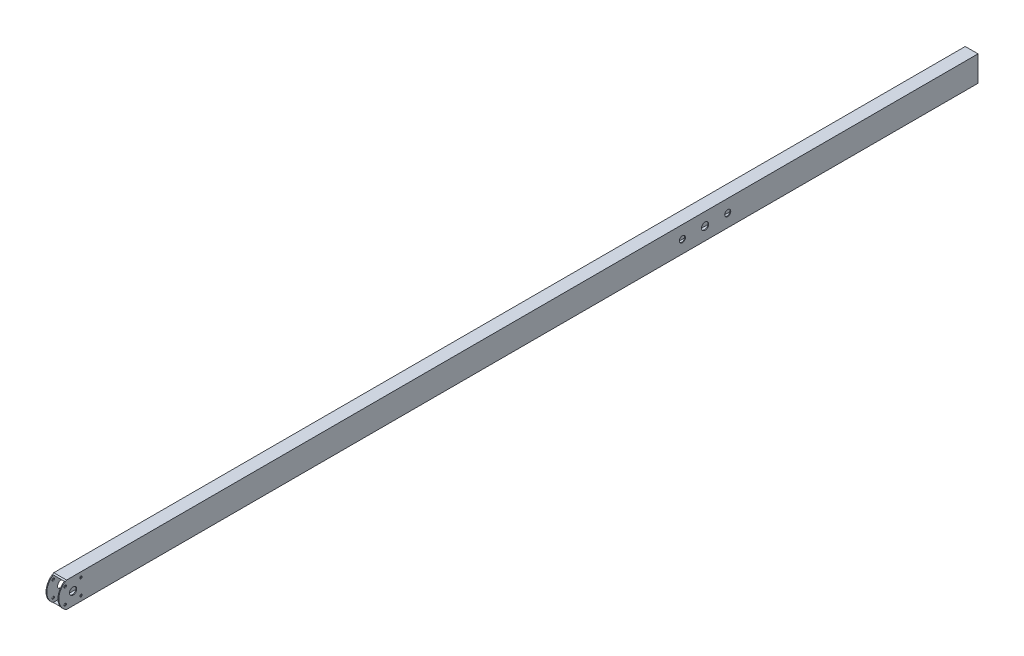
ISO-10303-21;
HEADER;
FILE_DESCRIPTION(('STEP AP214'),'2;1');
FILE_NAME('part.step','',(''),(''),'','','');
FILE_SCHEMA(('AUTOMOTIVE_DESIGN { 1 0 10303 214 1 1 1 1 }'));
ENDSEC;
DATA;
#1=APPLICATION_CONTEXT('core data for automotive mechanical design processes');
#2=APPLICATION_PROTOCOL_DEFINITION('international standard','automotive_design',2000,#1);
#3=PRODUCT_CONTEXT('',#1,'mechanical');
#4=PRODUCT('Part','Part','',(#3));
#5=PRODUCT_RELATED_PRODUCT_CATEGORY('part','',(#4));
#6=PRODUCT_DEFINITION_FORMATION('','',#4);
#7=PRODUCT_DEFINITION_CONTEXT('part definition',#1,'design');
#8=PRODUCT_DEFINITION('design','',#6,#7);
#9=PRODUCT_DEFINITION_SHAPE('','',#8);
#10=(LENGTH_UNIT() NAMED_UNIT(*) SI_UNIT(.MILLI.,.METRE.));
#11=(NAMED_UNIT(*) PLANE_ANGLE_UNIT() SI_UNIT($,.RADIAN.));
#12=(NAMED_UNIT(*) SI_UNIT($,.STERADIAN.) SOLID_ANGLE_UNIT());
#13=UNCERTAINTY_MEASURE_WITH_UNIT(LENGTH_MEASURE(1.E-05),#10,'distance_accuracy_value','');
#14=(GEOMETRIC_REPRESENTATION_CONTEXT(3) GLOBAL_UNCERTAINTY_ASSIGNED_CONTEXT((#13)) GLOBAL_UNIT_ASSIGNED_CONTEXT((#10,
#11,#12)) REPRESENTATION_CONTEXT('',''));
#15=CARTESIAN_POINT('',(0.,0.,0.));
#16=DIRECTION('',(0.,0.,1.));
#17=DIRECTION('',(1.,0.,0.));
#18=AXIS2_PLACEMENT_3D('',#15,#16,#17);
#19=CARTESIAN_POINT('',(-12.7,-25.4,1828.8));
#20=DIRECTION('',(1.,0.,0.));
#21=DIRECTION('',(0.,0.,-1.));
#22=AXIS2_PLACEMENT_3D('',#19,#20,#21);
#23=PLANE('',#22);
#24=CARTESIAN_POINT('',(-12.7,15.7154482118807,1784.50955178813));
#25=DIRECTION('',(1.,0.,0.));
#26=DIRECTION('',(0.,0.,-1.));
#27=AXIS2_PLACEMENT_3D('',#24,#25,#26);
#28=CIRCLE('',#27,2.38124999999998);
#29=CARTESIAN_POINT('',(-12.7,15.7154482118807,1782.12830178813));
#30=VERTEX_POINT('',#29);
#31=EDGE_CURVE('E378',#30,#30,#28,.T.);
#32=ORIENTED_EDGE('',*,*,#31,.T.);
#33=EDGE_LOOP('',(#32));
#34=FACE_BOUND('',#33,.T.);
#35=CARTESIAN_POINT('',(-12.7,-15.7154482118709,1784.50955178813));
#36=DIRECTION('',(1.,0.,0.));
#37=DIRECTION('',(0.,0.,-1.));
#38=AXIS2_PLACEMENT_3D('',#35,#36,#37);
#39=CIRCLE('',#38,2.38124999999998);
#40=CARTESIAN_POINT('',(-12.7,-15.7154482118709,1782.12830178813));
#41=VERTEX_POINT('',#40);
#42=EDGE_CURVE('E381',#41,#41,#39,.T.);
#43=ORIENTED_EDGE('',*,*,#42,.T.);
#44=EDGE_LOOP('',(#43));
#45=FACE_BOUND('',#44,.T.);
#46=CARTESIAN_POINT('',(-12.7,-15.7154482118708,1815.94044821187));
#47=DIRECTION('',(1.,0.,0.));
#48=DIRECTION('',(0.,0.,-1.));
#49=AXIS2_PLACEMENT_3D('',#46,#47,#48);
#50=CIRCLE('',#49,2.38124999999998);
#51=CARTESIAN_POINT('',(-12.7,-15.7154482118708,1813.55919821187));
#52=VERTEX_POINT('',#51);
#53=EDGE_CURVE('E215',#52,#52,#50,.T.);
#54=ORIENTED_EDGE('',*,*,#53,.T.);
#55=EDGE_LOOP('',(#54));
#56=FACE_BOUND('',#55,.T.);
#57=CARTESIAN_POINT('',(-12.7,15.7154482118712,1815.94044821187));
#58=DIRECTION('',(1.,0.,0.));
#59=DIRECTION('',(0.,0.,-1.));
#60=AXIS2_PLACEMENT_3D('',#57,#58,#59);
#61=CIRCLE('',#60,2.38124999999998);
#62=CARTESIAN_POINT('',(-12.7,15.7154482118712,1813.55919821187));
#63=VERTEX_POINT('',#62);
#64=EDGE_CURVE('E210',#63,#63,#61,.T.);
#65=ORIENTED_EDGE('',*,*,#64,.T.);
#66=EDGE_LOOP('',(#65));
#67=FACE_BOUND('',#66,.T.);
#68=CARTESIAN_POINT('',(-12.7,0.,587.9703125));
#69=DIRECTION('',(1.,0.,0.));
#70=DIRECTION('',(0.,0.,-1.));
#71=AXIS2_PLACEMENT_3D('',#68,#69,#70);
#72=CIRCLE('',#71,5.99999999999999);
#73=CARTESIAN_POINT('',(-12.7,0.,581.9703125));
#74=VERTEX_POINT('',#73);
#75=EDGE_CURVE('E205',#74,#74,#72,.T.);
#76=ORIENTED_EDGE('',*,*,#75,.T.);
#77=EDGE_LOOP('',(#76));
#78=FACE_BOUND('',#77,.T.);
#79=CARTESIAN_POINT('',(-12.7,0.,497.8796875));
#80=DIRECTION('',(1.,0.,0.));
#81=DIRECTION('',(0.,0.,-1.));
#82=AXIS2_PLACEMENT_3D('',#79,#80,#81);
#83=CIRCLE('',#82,5.99999999999999);
#84=CARTESIAN_POINT('',(-12.7,0.,491.8796875));
#85=VERTEX_POINT('',#84);
#86=EDGE_CURVE('E199',#85,#85,#83,.T.);
#87=ORIENTED_EDGE('',*,*,#86,.T.);
#88=EDGE_LOOP('',(#87));
#89=FACE_BOUND('',#88,.T.);
#90=CARTESIAN_POINT('',(-12.7,0.,542.925));
#91=DIRECTION('',(1.,0.,0.));
#92=DIRECTION('',(0.,0.,-1.));
#93=AXIS2_PLACEMENT_3D('',#90,#91,#92);
#94=CIRCLE('',#93,7.14374999999999);
#95=CARTESIAN_POINT('',(-12.7,0.,535.78125));
#96=VERTEX_POINT('',#95);
#97=EDGE_CURVE('E193',#96,#96,#94,.T.);
#98=ORIENTED_EDGE('',*,*,#97,.T.);
#99=EDGE_LOOP('',(#98));
#100=FACE_BOUND('',#99,.T.);
#101=CARTESIAN_POINT('',(-12.7,0.,1800.225));
#102=DIRECTION('',(1.,0.,0.));
#103=DIRECTION('',(0.,0.,-1.));
#104=AXIS2_PLACEMENT_3D('',#101,#102,#103);
#105=CIRCLE('',#104,7.14374999999999);
#106=CARTESIAN_POINT('',(-12.7,0.,1793.08125));
#107=VERTEX_POINT('',#106);
#108=EDGE_CURVE('E187',#107,#107,#105,.T.);
#109=ORIENTED_EDGE('',*,*,#108,.T.);
#110=EDGE_LOOP('',(#109));
#111=FACE_BOUND('',#110,.T.);
#112=DIRECTION('',(0.,0.,-1.));
#113=VECTOR('',#112,1.);
#114=CARTESIAN_POINT('',(-12.7,-25.4,1828.8));
#115=LINE('',#114,#113);
#116=CARTESIAN_POINT('',(-12.7,-25.4,1813.31586036134));
#117=VERTEX_POINT('',#116);
#118=CARTESIAN_POINT('',(-12.7,-25.4,0.));
#119=VERTEX_POINT('',#118);
#120=EDGE_CURVE('E165',#117,#119,#115,.T.);
#121=ORIENTED_EDGE('',*,*,#120,.F.);
#122=CARTESIAN_POINT('',(-12.7,0.,1800.225));
#123=DIRECTION('',(1.,0.,0.));
#124=DIRECTION('',(0.,0.,-1.));
#125=AXIS2_PLACEMENT_3D('',#122,#123,#124);
#126=CIRCLE('',#125,28.575);
#127=CARTESIAN_POINT('',(-12.7,25.4,1813.31586036134));
#128=VERTEX_POINT('',#127);
#129=EDGE_CURVE('E149',#128,#117,#126,.T.);
#130=ORIENTED_EDGE('',*,*,#129,.F.);
#131=DIRECTION('',(0.,0.,-1.));
#132=VECTOR('',#131,1.);
#133=CARTESIAN_POINT('',(-12.7,25.4,1828.8));
#134=LINE('',#133,#132);
#135=CARTESIAN_POINT('',(-12.7,25.4,0.));
#136=VERTEX_POINT('',#135);
#137=EDGE_CURVE('E333',#128,#136,#134,.T.);
#138=ORIENTED_EDGE('',*,*,#137,.T.);
#139=DIRECTION('',(0.,-1.,0.));
#140=VECTOR('',#139,1.);
#141=CARTESIAN_POINT('',(-12.7,-25.4,0.));
#142=LINE('',#141,#140);
#143=EDGE_CURVE('E173',#136,#119,#142,.T.);
#144=ORIENTED_EDGE('',*,*,#143,.T.);
#145=EDGE_LOOP('',(#121,#130,#138,#144));
#146=FACE_BOUND('',#145,.T.);
#147=ADVANCED_FACE('F81',(#34,#45,#56,#67,#78,#89,#100,#111,#146),#23,.F.);
#148=CARTESIAN_POINT('',(12.7,-25.4,1828.8));
#149=DIRECTION('',(-1.,0.,0.));
#150=DIRECTION('',(0.,0.,1.));
#151=AXIS2_PLACEMENT_3D('',#148,#149,#150);
#152=PLANE('',#151);
#153=CARTESIAN_POINT('',(12.7,15.7154482118807,1784.50955178813));
#154=DIRECTION('',(1.,0.,0.));
#155=DIRECTION('',(0.,0.,-1.));
#156=AXIS2_PLACEMENT_3D('',#153,#154,#155);
#157=CIRCLE('',#156,2.38124999999999);
#158=CARTESIAN_POINT('',(12.7,15.7154482118807,1782.12830178813));
#159=VERTEX_POINT('',#158);
#160=EDGE_CURVE('E446',#159,#159,#157,.T.);
#161=ORIENTED_EDGE('',*,*,#160,.F.);
#162=EDGE_LOOP('',(#161));
#163=FACE_BOUND('',#162,.T.);
#164=CARTESIAN_POINT('',(12.7,-15.7154482118709,1784.50955178813));
#165=DIRECTION('',(1.,0.,0.));
#166=DIRECTION('',(0.,0.,-1.));
#167=AXIS2_PLACEMENT_3D('',#164,#165,#166);
#168=CIRCLE('',#167,2.38124999999999);
#169=CARTESIAN_POINT('',(12.7,-15.7154482118709,1782.12830178813));
#170=VERTEX_POINT('',#169);
#171=EDGE_CURVE('E458',#170,#170,#168,.T.);
#172=ORIENTED_EDGE('',*,*,#171,.F.);
#173=EDGE_LOOP('',(#172));
#174=FACE_BOUND('',#173,.T.);
#175=CARTESIAN_POINT('',(12.7,-15.7154482118708,1815.94044821187));
#176=DIRECTION('',(1.,0.,0.));
#177=DIRECTION('',(0.,0.,-1.));
#178=AXIS2_PLACEMENT_3D('',#175,#176,#177);
#179=CIRCLE('',#178,2.38124999999999);
#180=CARTESIAN_POINT('',(12.7,-15.7154482118708,1813.55919821187));
#181=VERTEX_POINT('',#180);
#182=EDGE_CURVE('E224',#181,#181,#179,.T.);
#183=ORIENTED_EDGE('',*,*,#182,.F.);
#184=EDGE_LOOP('',(#183));
#185=FACE_BOUND('',#184,.T.);
#186=CARTESIAN_POINT('',(12.7,15.7154482118712,1815.94044821187));
#187=DIRECTION('',(1.,0.,0.));
#188=DIRECTION('',(0.,0.,-1.));
#189=AXIS2_PLACEMENT_3D('',#186,#187,#188);
#190=CIRCLE('',#189,2.38124999999999);
#191=CARTESIAN_POINT('',(12.7,15.7154482118712,1813.55919821187));
#192=VERTEX_POINT('',#191);
#193=EDGE_CURVE('E221',#192,#192,#190,.T.);
#194=ORIENTED_EDGE('',*,*,#193,.F.);
#195=EDGE_LOOP('',(#194));
#196=FACE_BOUND('',#195,.T.);
#197=CARTESIAN_POINT('',(12.7,0.,587.9703125));
#198=DIRECTION('',(1.,0.,0.));
#199=DIRECTION('',(0.,0.,-1.));
#200=AXIS2_PLACEMENT_3D('',#197,#198,#199);
#201=CIRCLE('',#200,6.);
#202=CARTESIAN_POINT('',(12.7,0.,581.9703125));
#203=VERTEX_POINT('',#202);
#204=EDGE_CURVE('E243',#203,#203,#201,.T.);
#205=ORIENTED_EDGE('',*,*,#204,.F.);
#206=EDGE_LOOP('',(#205));
#207=FACE_BOUND('',#206,.T.);
#208=CARTESIAN_POINT('',(12.7,0.,497.8796875));
#209=DIRECTION('',(1.,0.,0.));
#210=DIRECTION('',(0.,0.,-1.));
#211=AXIS2_PLACEMENT_3D('',#208,#209,#210);
#212=CIRCLE('',#211,6.);
#213=CARTESIAN_POINT('',(12.7,0.,491.8796875));
#214=VERTEX_POINT('',#213);
#215=EDGE_CURVE('E253',#214,#214,#212,.T.);
#216=ORIENTED_EDGE('',*,*,#215,.F.);
#217=EDGE_LOOP('',(#216));
#218=FACE_BOUND('',#217,.T.);
#219=CARTESIAN_POINT('',(12.7,0.,542.925));
#220=DIRECTION('',(1.,0.,0.));
#221=DIRECTION('',(0.,0.,-1.));
#222=AXIS2_PLACEMENT_3D('',#219,#220,#221);
#223=CIRCLE('',#222,7.14375);
#224=CARTESIAN_POINT('',(12.7,0.,535.78125));
#225=VERTEX_POINT('',#224);
#226=EDGE_CURVE('E263',#225,#225,#223,.T.);
#227=ORIENTED_EDGE('',*,*,#226,.F.);
#228=EDGE_LOOP('',(#227));
#229=FACE_BOUND('',#228,.T.);
#230=CARTESIAN_POINT('',(12.7,0.,1800.225));
#231=DIRECTION('',(1.,0.,0.));
#232=DIRECTION('',(0.,0.,-1.));
#233=AXIS2_PLACEMENT_3D('',#230,#231,#232);
#234=CIRCLE('',#233,7.14375);
#235=CARTESIAN_POINT('',(12.7,0.,1793.08125));
#236=VERTEX_POINT('',#235);
#237=EDGE_CURVE('E273',#236,#236,#234,.T.);
#238=ORIENTED_EDGE('',*,*,#237,.F.);
#239=EDGE_LOOP('',(#238));
#240=FACE_BOUND('',#239,.T.);
#241=CARTESIAN_POINT('',(12.7,0.,1800.225));
#242=DIRECTION('',(1.,0.,0.));
#243=DIRECTION('',(0.,0.,-1.));
#244=AXIS2_PLACEMENT_3D('',#241,#242,#243);
#245=CIRCLE('',#244,28.575);
#246=CARTESIAN_POINT('',(12.7,25.4,1813.31586036134));
#247=VERTEX_POINT('',#246);
#248=CARTESIAN_POINT('',(12.7,-25.4,1813.31586036134));
#249=VERTEX_POINT('',#248);
#250=EDGE_CURVE('E160',#247,#249,#245,.T.);
#251=ORIENTED_EDGE('',*,*,#250,.T.);
#252=DIRECTION('',(0.,0.,-1.));
#253=VECTOR('',#252,1.);
#254=CARTESIAN_POINT('',(12.7,-25.4,1828.8));
#255=LINE('',#254,#253);
#256=CARTESIAN_POINT('',(12.7,-25.4,0.));
#257=VERTEX_POINT('',#256);
#258=EDGE_CURVE('E167',#249,#257,#255,.T.);
#259=ORIENTED_EDGE('',*,*,#258,.T.);
#260=DIRECTION('',(0.,1.,0.));
#261=VECTOR('',#260,1.);
#262=CARTESIAN_POINT('',(12.7,-25.4,0.));
#263=LINE('',#262,#261);
#264=CARTESIAN_POINT('',(12.7,25.4,0.));
#265=VERTEX_POINT('',#264);
#266=EDGE_CURVE('E325',#257,#265,#263,.T.);
#267=ORIENTED_EDGE('',*,*,#266,.T.);
#268=DIRECTION('',(0.,0.,-1.));
#269=VECTOR('',#268,1.);
#270=CARTESIAN_POINT('',(12.7,25.4,1828.8));
#271=LINE('',#270,#269);
#272=EDGE_CURVE('E179',#247,#265,#271,.T.);
#273=ORIENTED_EDGE('',*,*,#272,.F.);
#274=EDGE_LOOP('',(#251,#259,#267,#273));
#275=FACE_BOUND('',#274,.T.);
#276=ADVANCED_FACE('F342',(#163,#174,#185,#196,#207,#218,#229,#240,#275),#152,.F.);
#277=CARTESIAN_POINT('',(-11.1125,-25.4,1828.8));
#278=DIRECTION('',(1.,0.,0.));
#279=DIRECTION('',(0.,0.,-1.));
#280=AXIS2_PLACEMENT_3D('',#277,#278,#279);
#281=PLANE('',#280);
#282=CARTESIAN_POINT('',(-11.1125,15.7154482118807,1784.50955178813));
#283=DIRECTION('',(1.,0.,0.));
#284=DIRECTION('',(0.,0.,-1.));
#285=AXIS2_PLACEMENT_3D('',#282,#283,#284);
#286=CIRCLE('',#285,2.38124999999999);
#287=CARTESIAN_POINT('',(-11.1125,15.7154482118807,1782.12830178813));
#288=VERTEX_POINT('',#287);
#289=EDGE_CURVE('E444',#288,#288,#286,.T.);
#290=ORIENTED_EDGE('',*,*,#289,.F.);
#291=EDGE_LOOP('',(#290));
#292=FACE_BOUND('',#291,.T.);
#293=CARTESIAN_POINT('',(-11.1125,-15.7154482118709,1784.50955178813));
#294=DIRECTION('',(1.,0.,0.));
#295=DIRECTION('',(0.,0.,-1.));
#296=AXIS2_PLACEMENT_3D('',#293,#294,#295);
#297=CIRCLE('',#296,2.38124999999999);
#298=CARTESIAN_POINT('',(-11.1125,-15.7154482118709,1782.12830178813));
#299=VERTEX_POINT('',#298);
#300=EDGE_CURVE('E84',#299,#299,#297,.T.);
#301=ORIENTED_EDGE('',*,*,#300,.F.);
#302=EDGE_LOOP('',(#301));
#303=FACE_BOUND('',#302,.T.);
#304=CARTESIAN_POINT('',(-11.1125,-15.7154482118708,1815.94044821187));
#305=DIRECTION('',(1.,0.,0.));
#306=DIRECTION('',(0.,0.,-1.));
#307=AXIS2_PLACEMENT_3D('',#304,#305,#306);
#308=CIRCLE('',#307,2.38124999999999);
#309=CARTESIAN_POINT('',(-11.1125,-15.7154482118708,1813.55919821187));
#310=VERTEX_POINT('',#309);
#311=EDGE_CURVE('E214',#310,#310,#308,.T.);
#312=ORIENTED_EDGE('',*,*,#311,.F.);
#313=EDGE_LOOP('',(#312));
#314=FACE_BOUND('',#313,.T.);
#315=CARTESIAN_POINT('',(-11.1125,15.7154482118712,1815.94044821187));
#316=DIRECTION('',(1.,0.,0.));
#317=DIRECTION('',(0.,0.,-1.));
#318=AXIS2_PLACEMENT_3D('',#315,#316,#317);
#319=CIRCLE('',#318,2.38124999999999);
#320=CARTESIAN_POINT('',(-11.1125,15.7154482118712,1813.55919821187));
#321=VERTEX_POINT('',#320);
#322=EDGE_CURVE('E206',#321,#321,#319,.T.);
#323=ORIENTED_EDGE('',*,*,#322,.F.);
#324=EDGE_LOOP('',(#323));
#325=FACE_BOUND('',#324,.T.);
#326=CARTESIAN_POINT('',(-11.1125,0.,587.9703125));
#327=DIRECTION('',(1.,0.,0.));
#328=DIRECTION('',(0.,0.,-1.));
#329=AXIS2_PLACEMENT_3D('',#326,#327,#328);
#330=CIRCLE('',#329,5.99999999999999);
#331=CARTESIAN_POINT('',(-11.1125,0.,581.9703125));
#332=VERTEX_POINT('',#331);
#333=EDGE_CURVE('E204',#332,#332,#330,.T.);
#334=ORIENTED_EDGE('',*,*,#333,.F.);
#335=EDGE_LOOP('',(#334));
#336=FACE_BOUND('',#335,.T.);
#337=CARTESIAN_POINT('',(-11.1125,0.,497.8796875));
#338=DIRECTION('',(1.,0.,0.));
#339=DIRECTION('',(0.,0.,-1.));
#340=AXIS2_PLACEMENT_3D('',#337,#338,#339);
#341=CIRCLE('',#340,5.99999999999999);
#342=CARTESIAN_POINT('',(-11.1125,0.,491.8796875));
#343=VERTEX_POINT('',#342);
#344=EDGE_CURVE('E194',#343,#343,#341,.T.);
#345=ORIENTED_EDGE('',*,*,#344,.F.);
#346=EDGE_LOOP('',(#345));
#347=FACE_BOUND('',#346,.T.);
#348=CARTESIAN_POINT('',(-11.1125,0.,542.925));
#349=DIRECTION('',(1.,0.,0.));
#350=DIRECTION('',(0.,0.,-1.));
#351=AXIS2_PLACEMENT_3D('',#348,#349,#350);
#352=CIRCLE('',#351,7.14375);
#353=CARTESIAN_POINT('',(-11.1125,0.,535.78125));
#354=VERTEX_POINT('',#353);
#355=EDGE_CURVE('E192',#354,#354,#352,.T.);
#356=ORIENTED_EDGE('',*,*,#355,.F.);
#357=EDGE_LOOP('',(#356));
#358=FACE_BOUND('',#357,.T.);
#359=CARTESIAN_POINT('',(-11.1125,0.,1800.225));
#360=DIRECTION('',(1.,0.,0.));
#361=DIRECTION('',(0.,0.,-1.));
#362=AXIS2_PLACEMENT_3D('',#359,#360,#361);
#363=CIRCLE('',#362,7.14375);
#364=CARTESIAN_POINT('',(-11.1125,0.,1793.08125));
#365=VERTEX_POINT('',#364);
#366=EDGE_CURVE('E183',#365,#365,#363,.T.);
#367=ORIENTED_EDGE('',*,*,#366,.F.);
#368=EDGE_LOOP('',(#367));
#369=FACE_BOUND('',#368,.T.);
#370=CARTESIAN_POINT('',(-11.1125,0.,1800.225));
#371=DIRECTION('',(1.,0.,0.));
#372=DIRECTION('',(0.,0.,-1.));
#373=AXIS2_PLACEMENT_3D('',#370,#371,#372);
#374=CIRCLE('',#373,28.575);
#375=CARTESIAN_POINT('',(-11.1125,23.8125,1816.02042556407));
#376=VERTEX_POINT('',#375);
#377=CARTESIAN_POINT('',(-11.1125,-23.8125,1816.02042556407));
#378=VERTEX_POINT('',#377);
#379=EDGE_CURVE('E98',#376,#378,#374,.T.);
#380=ORIENTED_EDGE('',*,*,#379,.T.);
#381=DIRECTION('',(0.,0.,-1.));
#382=VECTOR('',#381,1.);
#383=CARTESIAN_POINT('',(-11.1125,-23.8125,1828.8));
#384=LINE('',#383,#382);
#385=CARTESIAN_POINT('',(-11.1125,-23.8125,0.));
#386=VERTEX_POINT('',#385);
#387=EDGE_CURVE('E317',#378,#386,#384,.T.);
#388=ORIENTED_EDGE('',*,*,#387,.T.);
#389=DIRECTION('',(0.,-1.,0.));
#390=VECTOR('',#389,1.);
#391=CARTESIAN_POINT('',(-11.1125,-25.4,0.));
#392=LINE('',#391,#390);
#393=CARTESIAN_POINT('',(-11.1125,23.8125,0.));
#394=VERTEX_POINT('',#393);
#395=EDGE_CURVE('E293',#394,#386,#392,.T.);
#396=ORIENTED_EDGE('',*,*,#395,.F.);
#397=DIRECTION('',(0.,0.,-1.));
#398=VECTOR('',#397,1.);
#399=CARTESIAN_POINT('',(-11.1125,23.8125,1828.8));
#400=LINE('',#399,#398);
#401=EDGE_CURVE('E105',#376,#394,#400,.T.);
#402=ORIENTED_EDGE('',*,*,#401,.F.);
#403=EDGE_LOOP('',(#380,#388,#396,#402));
#404=FACE_BOUND('',#403,.T.);
#405=ADVANCED_FACE('F351',(#292,#303,#314,#325,#336,#347,#358,#369,#404),#281,.T.);
#406=CARTESIAN_POINT('',(11.1125,-25.4,1828.8));
#407=DIRECTION('',(-1.,0.,0.));
#408=DIRECTION('',(0.,0.,1.));
#409=AXIS2_PLACEMENT_3D('',#406,#407,#408);
#410=PLANE('',#409);
#411=CARTESIAN_POINT('',(11.1125,15.7154482118807,1784.50955178813));
#412=DIRECTION('',(-1.,0.,0.));
#413=DIRECTION('',(0.,0.,1.));
#414=AXIS2_PLACEMENT_3D('',#411,#412,#413);
#415=CIRCLE('',#414,2.38124999999999);
#416=CARTESIAN_POINT('',(11.1125,15.7154482118807,1786.89080178813));
#417=VERTEX_POINT('',#416);
#418=EDGE_CURVE('E450',#417,#417,#415,.T.);
#419=ORIENTED_EDGE('',*,*,#418,.F.);
#420=EDGE_LOOP('',(#419));
#421=FACE_BOUND('',#420,.T.);
#422=CARTESIAN_POINT('',(11.1125,-15.7154482118709,1784.50955178813));
#423=DIRECTION('',(-1.,0.,0.));
#424=DIRECTION('',(0.,0.,1.));
#425=AXIS2_PLACEMENT_3D('',#422,#423,#424);
#426=CIRCLE('',#425,2.38124999999999);
#427=CARTESIAN_POINT('',(11.1125,-15.7154482118709,1786.89080178813));
#428=VERTEX_POINT('',#427);
#429=EDGE_CURVE('E230',#428,#428,#426,.T.);
#430=ORIENTED_EDGE('',*,*,#429,.F.);
#431=EDGE_LOOP('',(#430));
#432=FACE_BOUND('',#431,.T.);
#433=CARTESIAN_POINT('',(11.1125,-15.7154482118708,1815.94044821187));
#434=DIRECTION('',(-1.,0.,0.));
#435=DIRECTION('',(0.,0.,1.));
#436=AXIS2_PLACEMENT_3D('',#433,#434,#435);
#437=CIRCLE('',#436,2.38124999999999);
#438=CARTESIAN_POINT('',(11.1125,-15.7154482118708,1818.32169821187));
#439=VERTEX_POINT('',#438);
#440=EDGE_CURVE('E211',#439,#439,#437,.T.);
#441=ORIENTED_EDGE('',*,*,#440,.F.);
#442=EDGE_LOOP('',(#441));
#443=FACE_BOUND('',#442,.T.);
#444=CARTESIAN_POINT('',(11.1125,15.7154482118712,1815.94044821187));
#445=DIRECTION('',(-1.,0.,0.));
#446=DIRECTION('',(0.,0.,1.));
#447=AXIS2_PLACEMENT_3D('',#444,#445,#446);
#448=CIRCLE('',#447,2.38124999999999);
#449=CARTESIAN_POINT('',(11.1125,15.7154482118712,1818.32169821187));
#450=VERTEX_POINT('',#449);
#451=EDGE_CURVE('E209',#450,#450,#448,.T.);
#452=ORIENTED_EDGE('',*,*,#451,.F.);
#453=EDGE_LOOP('',(#452));
#454=FACE_BOUND('',#453,.T.);
#455=CARTESIAN_POINT('',(11.1125,0.,587.9703125));
#456=DIRECTION('',(-1.,0.,0.));
#457=DIRECTION('',(0.,0.,1.));
#458=AXIS2_PLACEMENT_3D('',#455,#456,#457);
#459=CIRCLE('',#458,5.99999999999999);
#460=CARTESIAN_POINT('',(11.1125,0.,593.9703125));
#461=VERTEX_POINT('',#460);
#462=EDGE_CURVE('E200',#461,#461,#459,.T.);
#463=ORIENTED_EDGE('',*,*,#462,.F.);
#464=EDGE_LOOP('',(#463));
#465=FACE_BOUND('',#464,.T.);
#466=CARTESIAN_POINT('',(11.1125,0.,497.8796875));
#467=DIRECTION('',(-1.,0.,0.));
#468=DIRECTION('',(0.,0.,1.));
#469=AXIS2_PLACEMENT_3D('',#466,#467,#468);
#470=CIRCLE('',#469,5.99999999999999);
#471=CARTESIAN_POINT('',(11.1125,0.,503.8796875));
#472=VERTEX_POINT('',#471);
#473=EDGE_CURVE('E198',#472,#472,#470,.T.);
#474=ORIENTED_EDGE('',*,*,#473,.F.);
#475=EDGE_LOOP('',(#474));
#476=FACE_BOUND('',#475,.T.);
#477=CARTESIAN_POINT('',(11.1125,0.,542.925));
#478=DIRECTION('',(-1.,0.,0.));
#479=DIRECTION('',(0.,0.,1.));
#480=AXIS2_PLACEMENT_3D('',#477,#478,#479);
#481=CIRCLE('',#480,7.14375);
#482=CARTESIAN_POINT('',(11.1125,0.,550.06875));
#483=VERTEX_POINT('',#482);
#484=EDGE_CURVE('E188',#483,#483,#481,.T.);
#485=ORIENTED_EDGE('',*,*,#484,.F.);
#486=EDGE_LOOP('',(#485));
#487=FACE_BOUND('',#486,.T.);
#488=CARTESIAN_POINT('',(11.1125,0.,1800.225));
#489=DIRECTION('',(-1.,0.,0.));
#490=DIRECTION('',(0.,0.,1.));
#491=AXIS2_PLACEMENT_3D('',#488,#489,#490);
#492=CIRCLE('',#491,7.14375);
#493=CARTESIAN_POINT('',(11.1125,0.,1807.36875));
#494=VERTEX_POINT('',#493);
#495=EDGE_CURVE('E169',#494,#494,#492,.T.);
#496=ORIENTED_EDGE('',*,*,#495,.F.);
#497=EDGE_LOOP('',(#496));
#498=FACE_BOUND('',#497,.T.);
#499=DIRECTION('',(0.,0.,-1.));
#500=VECTOR('',#499,1.);
#501=CARTESIAN_POINT('',(11.1125,-23.8125,1828.8));
#502=LINE('',#501,#500);
#503=CARTESIAN_POINT('',(11.1125,-23.8125,1816.02042556407));
#504=VERTEX_POINT('',#503);
#505=CARTESIAN_POINT('',(11.1125,-23.8125,0.));
#506=VERTEX_POINT('',#505);
#507=EDGE_CURVE('E314',#504,#506,#502,.T.);
#508=ORIENTED_EDGE('',*,*,#507,.F.);
#509=CARTESIAN_POINT('',(11.1125,0.,1800.225));
#510=DIRECTION('',(-1.,0.,0.));
#511=DIRECTION('',(0.,0.,1.));
#512=AXIS2_PLACEMENT_3D('',#509,#510,#511);
#513=CIRCLE('',#512,28.575);
#514=CARTESIAN_POINT('',(11.1125,23.8125,1816.02042556407));
#515=VERTEX_POINT('',#514);
#516=EDGE_CURVE('E287',#504,#515,#513,.T.);
#517=ORIENTED_EDGE('',*,*,#516,.T.);
#518=DIRECTION('',(0.,0.,-1.));
#519=VECTOR('',#518,1.);
#520=CARTESIAN_POINT('',(11.1125,23.8125,1828.8));
#521=LINE('',#520,#519);
#522=CARTESIAN_POINT('',(11.1125,23.8125,0.));
#523=VERTEX_POINT('',#522);
#524=EDGE_CURVE('E311',#515,#523,#521,.T.);
#525=ORIENTED_EDGE('',*,*,#524,.T.);
#526=DIRECTION('',(0.,1.,0.));
#527=VECTOR('',#526,1.);
#528=CARTESIAN_POINT('',(11.1125,-25.4,0.));
#529=LINE('',#528,#527);
#530=EDGE_CURVE('E301',#506,#523,#529,.T.);
#531=ORIENTED_EDGE('',*,*,#530,.F.);
#532=EDGE_LOOP('',(#508,#517,#525,#531));
#533=FACE_BOUND('',#532,.T.);
#534=ADVANCED_FACE('F358',(#421,#432,#443,#454,#465,#476,#487,#498,#533),#410,.T.);
#535=CARTESIAN_POINT('',(12.7,-25.4,1828.8));
#536=DIRECTION('',(0.,1.,0.));
#537=DIRECTION('',(-1.,0.,0.));
#538=AXIS2_PLACEMENT_3D('',#535,#536,#537);
#539=PLANE('',#538);
#540=DIRECTION('',(1.,0.,0.));
#541=VECTOR('',#540,1.);
#542=CARTESIAN_POINT('',(-12.7,-25.4,1813.31586036134));
#543=LINE('',#542,#541);
#544=EDGE_CURVE('E152',#117,#249,#543,.T.);
#545=ORIENTED_EDGE('',*,*,#544,.F.);
#546=ORIENTED_EDGE('',*,*,#120,.T.);
#547=DIRECTION('',(1.,0.,0.));
#548=VECTOR('',#547,1.);
#549=CARTESIAN_POINT('',(12.7,-25.4,0.));
#550=LINE('',#549,#548);
#551=EDGE_CURVE('E322',#119,#257,#550,.T.);
#552=ORIENTED_EDGE('',*,*,#551,.T.);
#553=ORIENTED_EDGE('',*,*,#258,.F.);
#554=EDGE_LOOP('',(#545,#546,#552,#553));
#555=FACE_BOUND('',#554,.T.);
#556=ADVANCED_FACE('F163',(#555),#539,.F.);
#557=CARTESIAN_POINT('',(12.7,-23.8125,1828.8));
#558=DIRECTION('',(0.,1.,0.));
#559=DIRECTION('',(-1.,0.,0.));
#560=AXIS2_PLACEMENT_3D('',#557,#558,#559);
#561=PLANE('',#560);
#562=ORIENTED_EDGE('',*,*,#387,.F.);
#563=DIRECTION('',(1.,0.,0.));
#564=VECTOR('',#563,1.);
#565=CARTESIAN_POINT('',(-12.7,-23.8125,1816.02042556407));
#566=LINE('',#565,#564);
#567=EDGE_CURVE('E12',#378,#504,#566,.T.);
#568=ORIENTED_EDGE('',*,*,#567,.T.);
#569=ORIENTED_EDGE('',*,*,#507,.T.);
#570=DIRECTION('',(1.,0.,0.));
#571=VECTOR('',#570,1.);
#572=CARTESIAN_POINT('',(12.7,-23.8125,0.));
#573=LINE('',#572,#571);
#574=EDGE_CURVE('E297',#386,#506,#573,.T.);
#575=ORIENTED_EDGE('',*,*,#574,.F.);
#576=EDGE_LOOP('',(#562,#568,#569,#575));
#577=FACE_BOUND('',#576,.T.);
#578=ADVANCED_FACE('F354',(#577),#561,.T.);
#579=CARTESIAN_POINT('',(12.7,25.4,1828.8));
#580=DIRECTION('',(0.,-1.,0.));
#581=DIRECTION('',(1.,0.,0.));
#582=AXIS2_PLACEMENT_3D('',#579,#580,#581);
#583=PLANE('',#582);
#584=DIRECTION('',(1.,0.,0.));
#585=VECTOR('',#584,1.);
#586=CARTESIAN_POINT('',(-12.7,25.4,1813.31586036134));
#587=LINE('',#586,#585);
#588=EDGE_CURVE('E155',#128,#247,#587,.T.);
#589=ORIENTED_EDGE('',*,*,#588,.T.);
#590=ORIENTED_EDGE('',*,*,#272,.T.);
#591=DIRECTION('',(-1.,0.,0.));
#592=VECTOR('',#591,1.);
#593=CARTESIAN_POINT('',(12.7,25.4,0.));
#594=LINE('',#593,#592);
#595=EDGE_CURVE('E329',#265,#136,#594,.T.);
#596=ORIENTED_EDGE('',*,*,#595,.T.);
#597=ORIENTED_EDGE('',*,*,#137,.F.);
#598=EDGE_LOOP('',(#589,#590,#596,#597));
#599=FACE_BOUND('',#598,.T.);
#600=ADVANCED_FACE('F338',(#599),#583,.F.);
#601=CARTESIAN_POINT('',(12.7,23.8125,1828.8));
#602=DIRECTION('',(0.,-1.,0.));
#603=DIRECTION('',(1.,0.,0.));
#604=AXIS2_PLACEMENT_3D('',#601,#602,#603);
#605=PLANE('',#604);
#606=ORIENTED_EDGE('',*,*,#524,.F.);
#607=DIRECTION('',(1.,0.,0.));
#608=VECTOR('',#607,1.);
#609=CARTESIAN_POINT('',(-12.7,23.8125,1816.02042556407));
#610=LINE('',#609,#608);
#611=EDGE_CURVE('E90',#515,#376,#610,.F.);
#612=ORIENTED_EDGE('',*,*,#611,.T.);
#613=ORIENTED_EDGE('',*,*,#401,.T.);
#614=DIRECTION('',(-1.,0.,0.));
#615=VECTOR('',#614,1.);
#616=CARTESIAN_POINT('',(12.7,23.8125,0.));
#617=LINE('',#616,#615);
#618=EDGE_CURVE('E305',#523,#394,#617,.T.);
#619=ORIENTED_EDGE('',*,*,#618,.F.);
#620=EDGE_LOOP('',(#606,#612,#613,#619));
#621=FACE_BOUND('',#620,.T.);
#622=ADVANCED_FACE('F347',(#621),#605,.T.);
#623=CARTESIAN_POINT('',(0.,0.,0.));
#624=DIRECTION('',(0.,0.,1.));
#625=DIRECTION('',(1.,0.,0.));
#626=AXIS2_PLACEMENT_3D('',#623,#624,#625);
#627=PLANE('',#626);
#628=ORIENTED_EDGE('',*,*,#143,.F.);
#629=ORIENTED_EDGE('',*,*,#595,.F.);
#630=ORIENTED_EDGE('',*,*,#266,.F.);
#631=ORIENTED_EDGE('',*,*,#551,.F.);
#632=EDGE_LOOP('',(#628,#629,#630,#631));
#633=FACE_BOUND('',#632,.T.);
#634=ORIENTED_EDGE('',*,*,#395,.T.);
#635=ORIENTED_EDGE('',*,*,#574,.T.);
#636=ORIENTED_EDGE('',*,*,#530,.T.);
#637=ORIENTED_EDGE('',*,*,#618,.T.);
#638=EDGE_LOOP('',(#634,#635,#636,#637));
#639=FACE_BOUND('',#638,.T.);
#640=ADVANCED_FACE('F344',(#633,#639),#627,.F.);
#641=CARTESIAN_POINT('',(-12.7,0.,1800.225));
#642=DIRECTION('',(1.,0.,0.));
#643=DIRECTION('',(0.,0.,-1.));
#644=AXIS2_PLACEMENT_3D('',#641,#642,#643);
#645=CYLINDRICAL_SURFACE('',#644,28.575);
#646=ORIENTED_EDGE('',*,*,#544,.T.);
#647=ORIENTED_EDGE('',*,*,#250,.F.);
#648=ORIENTED_EDGE('',*,*,#588,.F.);
#649=ORIENTED_EDGE('',*,*,#129,.T.);
#650=EDGE_LOOP('',(#646,#647,#648,#649));
#651=FACE_BOUND('',#650,.T.);
#652=ORIENTED_EDGE('',*,*,#611,.F.);
#653=ORIENTED_EDGE('',*,*,#516,.F.);
#654=ORIENTED_EDGE('',*,*,#567,.F.);
#655=ORIENTED_EDGE('',*,*,#379,.F.);
#656=EDGE_LOOP('',(#652,#653,#654,#655));
#657=FACE_BOUND('',#656,.T.);
#658=ADVANCED_FACE('F151',(#651,#657),#645,.T.);
#659=CARTESIAN_POINT('',(12.7,0.,1800.225));
#660=DIRECTION('',(1.,0.,0.));
#661=DIRECTION('',(0.,0.,-1.));
#662=AXIS2_PLACEMENT_3D('',#659,#660,#661);
#663=CYLINDRICAL_SURFACE('',#662,7.14375);
#664=ORIENTED_EDGE('',*,*,#366,.T.);
#665=EDGE_LOOP('',(#664));
#666=FACE_BOUND('',#665,.T.);
#667=ORIENTED_EDGE('',*,*,#108,.F.);
#668=EDGE_LOOP('',(#667));
#669=FACE_BOUND('',#668,.T.);
#670=ADVANCED_FACE('F393',(#666,#669),#663,.F.);
#671=ORIENTED_EDGE('',*,*,#495,.T.);
#672=EDGE_LOOP('',(#671));
#673=FACE_BOUND('',#672,.T.);
#674=ORIENTED_EDGE('',*,*,#237,.T.);
#675=EDGE_LOOP('',(#674));
#676=FACE_BOUND('',#675,.T.);
#677=ADVANCED_FACE('F395',(#673,#676),#663,.F.);
#678=CARTESIAN_POINT('',(12.7,0.,542.925));
#679=DIRECTION('',(1.,0.,0.));
#680=DIRECTION('',(0.,0.,-1.));
#681=AXIS2_PLACEMENT_3D('',#678,#679,#680);
#682=CYLINDRICAL_SURFACE('',#681,7.14375);
#683=ORIENTED_EDGE('',*,*,#484,.T.);
#684=EDGE_LOOP('',(#683));
#685=FACE_BOUND('',#684,.T.);
#686=ORIENTED_EDGE('',*,*,#226,.T.);
#687=EDGE_LOOP('',(#686));
#688=FACE_BOUND('',#687,.T.);
#689=ADVANCED_FACE('F402',(#685,#688),#682,.F.);
#690=ORIENTED_EDGE('',*,*,#355,.T.);
#691=EDGE_LOOP('',(#690));
#692=FACE_BOUND('',#691,.T.);
#693=ORIENTED_EDGE('',*,*,#97,.F.);
#694=EDGE_LOOP('',(#693));
#695=FACE_BOUND('',#694,.T.);
#696=ADVANCED_FACE('F407',(#692,#695),#682,.F.);
#697=CARTESIAN_POINT('',(12.7,0.,497.8796875));
#698=DIRECTION('',(1.,0.,0.));
#699=DIRECTION('',(0.,0.,-1.));
#700=AXIS2_PLACEMENT_3D('',#697,#698,#699);
#701=CYLINDRICAL_SURFACE('',#700,5.99999999999999);
#702=ORIENTED_EDGE('',*,*,#344,.T.);
#703=EDGE_LOOP('',(#702));
#704=FACE_BOUND('',#703,.T.);
#705=ORIENTED_EDGE('',*,*,#86,.F.);
#706=EDGE_LOOP('',(#705));
#707=FACE_BOUND('',#706,.T.);
#708=ADVANCED_FACE('F409',(#704,#707),#701,.F.);
#709=ORIENTED_EDGE('',*,*,#473,.T.);
#710=EDGE_LOOP('',(#709));
#711=FACE_BOUND('',#710,.T.);
#712=ORIENTED_EDGE('',*,*,#215,.T.);
#713=EDGE_LOOP('',(#712));
#714=FACE_BOUND('',#713,.T.);
#715=ADVANCED_FACE('F412',(#711,#714),#701,.F.);
#716=CARTESIAN_POINT('',(12.7,0.,587.9703125));
#717=DIRECTION('',(1.,0.,0.));
#718=DIRECTION('',(0.,0.,-1.));
#719=AXIS2_PLACEMENT_3D('',#716,#717,#718);
#720=CYLINDRICAL_SURFACE('',#719,5.99999999999999);
#721=ORIENTED_EDGE('',*,*,#462,.T.);
#722=EDGE_LOOP('',(#721));
#723=FACE_BOUND('',#722,.T.);
#724=ORIENTED_EDGE('',*,*,#204,.T.);
#725=EDGE_LOOP('',(#724));
#726=FACE_BOUND('',#725,.T.);
#727=ADVANCED_FACE('F414',(#723,#726),#720,.F.);
#728=ORIENTED_EDGE('',*,*,#333,.T.);
#729=EDGE_LOOP('',(#728));
#730=FACE_BOUND('',#729,.T.);
#731=ORIENTED_EDGE('',*,*,#75,.F.);
#732=EDGE_LOOP('',(#731));
#733=FACE_BOUND('',#732,.T.);
#734=ADVANCED_FACE('F417',(#730,#733),#720,.F.);
#735=CARTESIAN_POINT('',(12.7,15.7154482118712,1815.94044821187));
#736=DIRECTION('',(1.,0.,0.));
#737=DIRECTION('',(0.,0.,-1.));
#738=AXIS2_PLACEMENT_3D('',#735,#736,#737);
#739=CYLINDRICAL_SURFACE('',#738,2.38124999999999);
#740=ORIENTED_EDGE('',*,*,#322,.T.);
#741=EDGE_LOOP('',(#740));
#742=FACE_BOUND('',#741,.T.);
#743=ORIENTED_EDGE('',*,*,#64,.F.);
#744=EDGE_LOOP('',(#743));
#745=FACE_BOUND('',#744,.T.);
#746=ADVANCED_FACE('F419',(#742,#745),#739,.F.);
#747=ORIENTED_EDGE('',*,*,#451,.T.);
#748=EDGE_LOOP('',(#747));
#749=FACE_BOUND('',#748,.T.);
#750=ORIENTED_EDGE('',*,*,#193,.T.);
#751=EDGE_LOOP('',(#750));
#752=FACE_BOUND('',#751,.T.);
#753=ADVANCED_FACE('F422',(#749,#752),#739,.F.);
#754=CARTESIAN_POINT('',(12.7,-15.7154482118708,1815.94044821187));
#755=DIRECTION('',(1.,0.,0.));
#756=DIRECTION('',(0.,0.,-1.));
#757=AXIS2_PLACEMENT_3D('',#754,#755,#756);
#758=CYLINDRICAL_SURFACE('',#757,2.38124999999999);
#759=ORIENTED_EDGE('',*,*,#440,.T.);
#760=EDGE_LOOP('',(#759));
#761=FACE_BOUND('',#760,.T.);
#762=ORIENTED_EDGE('',*,*,#182,.T.);
#763=EDGE_LOOP('',(#762));
#764=FACE_BOUND('',#763,.T.);
#765=ADVANCED_FACE('F424',(#761,#764),#758,.F.);
#766=ORIENTED_EDGE('',*,*,#311,.T.);
#767=EDGE_LOOP('',(#766));
#768=FACE_BOUND('',#767,.T.);
#769=ORIENTED_EDGE('',*,*,#53,.F.);
#770=EDGE_LOOP('',(#769));
#771=FACE_BOUND('',#770,.T.);
#772=ADVANCED_FACE('F427',(#768,#771),#758,.F.);
#773=CARTESIAN_POINT('',(12.7,-15.7154482118709,1784.50955178813));
#774=DIRECTION('',(1.,0.,0.));
#775=DIRECTION('',(0.,0.,-1.));
#776=AXIS2_PLACEMENT_3D('',#773,#774,#775);
#777=CYLINDRICAL_SURFACE('',#776,2.38124999999999);
#778=ORIENTED_EDGE('',*,*,#300,.T.);
#779=EDGE_LOOP('',(#778));
#780=FACE_BOUND('',#779,.T.);
#781=ORIENTED_EDGE('',*,*,#42,.F.);
#782=EDGE_LOOP('',(#781));
#783=FACE_BOUND('',#782,.T.);
#784=ADVANCED_FACE('F428',(#780,#783),#777,.F.);
#785=ORIENTED_EDGE('',*,*,#429,.T.);
#786=EDGE_LOOP('',(#785));
#787=FACE_BOUND('',#786,.T.);
#788=ORIENTED_EDGE('',*,*,#171,.T.);
#789=EDGE_LOOP('',(#788));
#790=FACE_BOUND('',#789,.T.);
#791=ADVANCED_FACE('F431',(#787,#790),#777,.F.);
#792=CARTESIAN_POINT('',(12.7,15.7154482118807,1784.50955178813));
#793=DIRECTION('',(1.,0.,0.));
#794=DIRECTION('',(0.,0.,-1.));
#795=AXIS2_PLACEMENT_3D('',#792,#793,#794);
#796=CYLINDRICAL_SURFACE('',#795,2.38124999999999);
#797=ORIENTED_EDGE('',*,*,#418,.T.);
#798=EDGE_LOOP('',(#797));
#799=FACE_BOUND('',#798,.T.);
#800=ORIENTED_EDGE('',*,*,#160,.T.);
#801=EDGE_LOOP('',(#800));
#802=FACE_BOUND('',#801,.T.);
#803=ADVANCED_FACE('F435',(#799,#802),#796,.F.);
#804=ORIENTED_EDGE('',*,*,#289,.T.);
#805=EDGE_LOOP('',(#804));
#806=FACE_BOUND('',#805,.T.);
#807=ORIENTED_EDGE('',*,*,#31,.F.);
#808=EDGE_LOOP('',(#807));
#809=FACE_BOUND('',#808,.T.);
#810=ADVANCED_FACE('F433',(#806,#809),#796,.F.);
#811=CLOSED_SHELL('',(#147,#276,#405,#534,#556,#578,#600,#622,#640,#658,#670,#677,#689,#696,
#708,#715,#727,#734,#746,#753,#765,#772,#784,#791,#803,#810));
#812=MANIFOLD_SOLID_BREP('B2',#811);
#813=ADVANCED_BREP_SHAPE_REPRESENTATION('',(#18,#812),#14);
#814=SHAPE_DEFINITION_REPRESENTATION(#9,#813);
ENDSEC;
END-ISO-10303-21;
